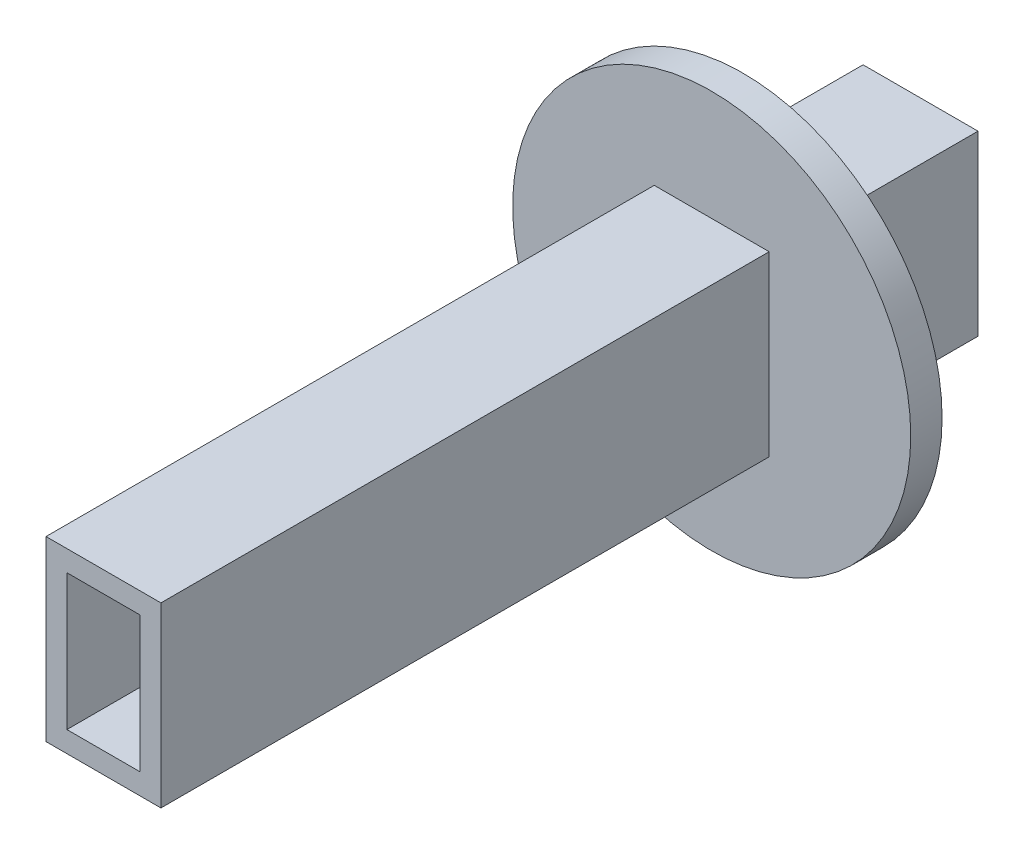
ISO-10303-21;
HEADER;
FILE_DESCRIPTION(('STEP AP214'),'2;1');
FILE_NAME('part.step','',(''),(''),'','','');
FILE_SCHEMA(('AUTOMOTIVE_DESIGN { 1 0 10303 214 1 1 1 1 }'));
ENDSEC;
DATA;
#1=APPLICATION_CONTEXT('core data for automotive mechanical design processes');
#2=APPLICATION_PROTOCOL_DEFINITION('international standard','automotive_design',2000,#1);
#3=PRODUCT_CONTEXT('',#1,'mechanical');
#4=PRODUCT('Part','Part','',(#3));
#5=PRODUCT_RELATED_PRODUCT_CATEGORY('part','',(#4));
#6=PRODUCT_DEFINITION_FORMATION('','',#4);
#7=PRODUCT_DEFINITION_CONTEXT('part definition',#1,'design');
#8=PRODUCT_DEFINITION('design','',#6,#7);
#9=PRODUCT_DEFINITION_SHAPE('','',#8);
#10=(LENGTH_UNIT() NAMED_UNIT(*) SI_UNIT(.MILLI.,.METRE.));
#11=(NAMED_UNIT(*) PLANE_ANGLE_UNIT() SI_UNIT($,.RADIAN.));
#12=(NAMED_UNIT(*) SI_UNIT($,.STERADIAN.) SOLID_ANGLE_UNIT());
#13=UNCERTAINTY_MEASURE_WITH_UNIT(LENGTH_MEASURE(1.E-05),#10,'distance_accuracy_value','');
#14=(GEOMETRIC_REPRESENTATION_CONTEXT(3) GLOBAL_UNCERTAINTY_ASSIGNED_CONTEXT((#13)) GLOBAL_UNIT_ASSIGNED_CONTEXT((#10,
#11,#12)) REPRESENTATION_CONTEXT('',''));
#15=CARTESIAN_POINT('',(0.,0.,0.));
#16=DIRECTION('',(0.,0.,1.));
#17=DIRECTION('',(1.,0.,0.));
#18=AXIS2_PLACEMENT_3D('',#15,#16,#17);
#19=CARTESIAN_POINT('',(3.5,6.5,14.986));
#20=DIRECTION('',(0.,0.,1.));
#21=DIRECTION('',(1.,0.,0.));
#22=AXIS2_PLACEMENT_3D('',#19,#20,#21);
#23=PLANE('',#22);
#24=CARTESIAN_POINT('',(3.5,6.5,14.986));
#25=DIRECTION('',(0.,0.,1.));
#26=DIRECTION('',(1.,0.,0.));
#27=AXIS2_PLACEMENT_3D('',#24,#25,#26);
#28=CIRCLE('',#27,19.05);
#29=CARTESIAN_POINT('',(22.55,6.5,14.986));
#30=VERTEX_POINT('',#29);
#31=EDGE_CURVE('E251',#30,#30,#28,.T.);
#32=ORIENTED_EDGE('',*,*,#31,.F.);
#33=EDGE_LOOP('',(#32));
#34=FACE_BOUND('',#33,.T.);
#35=CARTESIAN_POINT('',(3.5,6.5,14.986));
#36=DIRECTION('',(0.,0.,1.));
#37=DIRECTION('',(1.,0.,0.));
#38=AXIS2_PLACEMENT_3D('',#35,#36,#37);
#39=CIRCLE('',#38,12.7);
#40=CARTESIAN_POINT('',(16.2,6.5,14.986));
#41=VERTEX_POINT('',#40);
#42=EDGE_CURVE('E11',#41,#41,#39,.F.);
#43=ORIENTED_EDGE('',*,*,#42,.F.);
#44=EDGE_LOOP('',(#43));
#45=FACE_BOUND('',#44,.T.);
#46=ADVANCED_FACE('F36',(#34,#45),#23,.F.);
#47=CARTESIAN_POINT('',(-2.,-2.,76.2));
#48=DIRECTION('',(1.,0.,0.));
#49=DIRECTION('',(0.,0.,-1.));
#50=AXIS2_PLACEMENT_3D('',#47,#48,#49);
#51=PLANE('',#50);
#52=DIRECTION('',(0.,0.,-1.));
#53=VECTOR('',#52,1.);
#54=CARTESIAN_POINT('',(-2.,-2.,76.2));
#55=LINE('',#54,#53);
#56=CARTESIAN_POINT('',(-2.,-2.,12.446));
#57=VERTEX_POINT('',#56);
#58=CARTESIAN_POINT('',(-2.,-2.,-2.));
#59=VERTEX_POINT('',#58);
#60=EDGE_CURVE('E159',#57,#59,#55,.T.);
#61=ORIENTED_EDGE('',*,*,#60,.F.);
#62=DIRECTION('',(0.,1.,0.));
#63=VECTOR('',#62,1.);
#64=CARTESIAN_POINT('',(-2.,15.,12.446));
#65=LINE('',#64,#63);
#66=CARTESIAN_POINT('',(-2.,15.,12.446));
#67=VERTEX_POINT('',#66);
#68=EDGE_CURVE('E138',#57,#67,#65,.T.);
#69=ORIENTED_EDGE('',*,*,#68,.T.);
#70=DIRECTION('',(0.,0.,-1.));
#71=VECTOR('',#70,1.);
#72=CARTESIAN_POINT('',(-2.,15.,76.2));
#73=LINE('',#72,#71);
#74=CARTESIAN_POINT('',(-2.,15.,-2.));
#75=VERTEX_POINT('',#74);
#76=EDGE_CURVE('E179',#67,#75,#73,.T.);
#77=ORIENTED_EDGE('',*,*,#76,.T.);
#78=DIRECTION('',(0.,1.,0.));
#79=VECTOR('',#78,1.);
#80=CARTESIAN_POINT('',(-2.,-2.,-2.));
#81=LINE('',#80,#79);
#82=EDGE_CURVE('E173',#59,#75,#81,.T.);
#83=ORIENTED_EDGE('',*,*,#82,.F.);
#84=EDGE_LOOP('',(#61,#69,#77,#83));
#85=FACE_BOUND('',#84,.T.);
#86=ADVANCED_FACE('F177',(#85),#51,.F.);
#87=CARTESIAN_POINT('',(-2.,-2.,76.2));
#88=DIRECTION('',(0.,1.,0.));
#89=DIRECTION('',(0.,0.,1.));
#90=AXIS2_PLACEMENT_3D('',#87,#88,#89);
#91=PLANE('',#90);
#92=DIRECTION('',(0.,0.,-1.));
#93=VECTOR('',#92,1.);
#94=CARTESIAN_POINT('',(0.,-2.,0.));
#95=LINE('',#94,#93);
#96=CARTESIAN_POINT('',(0.,-2.,11.));
#97=VERTEX_POINT('',#96);
#98=CARTESIAN_POINT('',(0.,-2.,0.));
#99=VERTEX_POINT('',#98);
#100=EDGE_CURVE('E246',#97,#99,#95,.T.);
#101=ORIENTED_EDGE('',*,*,#100,.F.);
#102=DIRECTION('',(-1.,0.,0.));
#103=VECTOR('',#102,1.);
#104=CARTESIAN_POINT('',(7.,-2.,11.));
#105=LINE('',#104,#103);
#106=CARTESIAN_POINT('',(7.,-2.,11.));
#107=VERTEX_POINT('',#106);
#108=EDGE_CURVE('E242',#107,#97,#105,.T.);
#109=ORIENTED_EDGE('',*,*,#108,.F.);
#110=DIRECTION('',(0.,0.,1.));
#111=VECTOR('',#110,1.);
#112=CARTESIAN_POINT('',(7.,-2.,0.));
#113=LINE('',#112,#111);
#114=CARTESIAN_POINT('',(7.,-2.,0.));
#115=VERTEX_POINT('',#114);
#116=EDGE_CURVE('E239',#115,#107,#113,.T.);
#117=ORIENTED_EDGE('',*,*,#116,.F.);
#118=DIRECTION('',(1.,0.,0.));
#119=VECTOR('',#118,1.);
#120=CARTESIAN_POINT('',(7.,-2.,0.));
#121=LINE('',#120,#119);
#122=EDGE_CURVE('E238',#99,#115,#121,.T.);
#123=ORIENTED_EDGE('',*,*,#122,.F.);
#124=EDGE_LOOP('',(#101,#109,#117,#123));
#125=FACE_BOUND('',#124,.T.);
#126=DIRECTION('',(0.,0.,-1.));
#127=VECTOR('',#126,1.);
#128=CARTESIAN_POINT('',(9.,-2.,76.2));
#129=LINE('',#128,#127);
#130=CARTESIAN_POINT('',(9.,-2.,12.446));
#131=VERTEX_POINT('',#130);
#132=CARTESIAN_POINT('',(9.,-2.,-2.));
#133=VERTEX_POINT('',#132);
#134=EDGE_CURVE('E147',#131,#133,#129,.T.);
#135=ORIENTED_EDGE('',*,*,#134,.F.);
#136=DIRECTION('',(-1.,0.,0.));
#137=VECTOR('',#136,1.);
#138=CARTESIAN_POINT('',(9.,-2.,12.446));
#139=LINE('',#138,#137);
#140=EDGE_CURVE('E135',#131,#57,#139,.T.);
#141=ORIENTED_EDGE('',*,*,#140,.T.);
#142=ORIENTED_EDGE('',*,*,#60,.T.);
#143=DIRECTION('',(-1.,0.,0.));
#144=VECTOR('',#143,1.);
#145=CARTESIAN_POINT('',(9.,-2.,-2.));
#146=LINE('',#145,#144);
#147=EDGE_CURVE('E153',#133,#59,#146,.T.);
#148=ORIENTED_EDGE('',*,*,#147,.F.);
#149=EDGE_LOOP('',(#135,#141,#142,#148));
#150=FACE_BOUND('',#149,.T.);
#151=ADVANCED_FACE('F151',(#125,#150),#91,.F.);
#152=CARTESIAN_POINT('',(9.,-2.,76.2));
#153=DIRECTION('',(-1.,0.,0.));
#154=DIRECTION('',(0.,0.,1.));
#155=AXIS2_PLACEMENT_3D('',#152,#153,#154);
#156=PLANE('',#155);
#157=DIRECTION('',(0.,0.,-1.));
#158=VECTOR('',#157,1.);
#159=CARTESIAN_POINT('',(9.,15.,76.2));
#160=LINE('',#159,#158);
#161=CARTESIAN_POINT('',(9.,15.,12.446));
#162=VERTEX_POINT('',#161);
#163=CARTESIAN_POINT('',(9.,15.,-2.));
#164=VERTEX_POINT('',#163);
#165=EDGE_CURVE('E149',#162,#164,#160,.T.);
#166=ORIENTED_EDGE('',*,*,#165,.F.);
#167=DIRECTION('',(0.,-1.,0.));
#168=VECTOR('',#167,1.);
#169=CARTESIAN_POINT('',(9.,15.,12.446));
#170=LINE('',#169,#168);
#171=EDGE_CURVE('E51',#162,#131,#170,.T.);
#172=ORIENTED_EDGE('',*,*,#171,.T.);
#173=ORIENTED_EDGE('',*,*,#134,.T.);
#174=DIRECTION('',(0.,-1.,0.));
#175=VECTOR('',#174,1.);
#176=CARTESIAN_POINT('',(9.,-2.,-2.));
#177=LINE('',#176,#175);
#178=EDGE_CURVE('E175',#164,#133,#177,.T.);
#179=ORIENTED_EDGE('',*,*,#178,.F.);
#180=EDGE_LOOP('',(#166,#172,#173,#179));
#181=FACE_BOUND('',#180,.T.);
#182=ADVANCED_FACE('F145',(#181),#156,.F.);
#183=CARTESIAN_POINT('',(-2.,15.,76.2));
#184=DIRECTION('',(0.,-1.,0.));
#185=DIRECTION('',(0.,0.,-1.));
#186=AXIS2_PLACEMENT_3D('',#183,#184,#185);
#187=PLANE('',#186);
#188=ORIENTED_EDGE('',*,*,#76,.F.);
#189=DIRECTION('',(1.,0.,0.));
#190=VECTOR('',#189,1.);
#191=CARTESIAN_POINT('',(9.,15.,12.446));
#192=LINE('',#191,#190);
#193=EDGE_CURVE('E229',#67,#162,#192,.T.);
#194=ORIENTED_EDGE('',*,*,#193,.T.);
#195=ORIENTED_EDGE('',*,*,#165,.T.);
#196=DIRECTION('',(1.,0.,0.));
#197=VECTOR('',#196,1.);
#198=CARTESIAN_POINT('',(9.,15.,-2.));
#199=LINE('',#198,#197);
#200=EDGE_CURVE('E180',#75,#164,#199,.T.);
#201=ORIENTED_EDGE('',*,*,#200,.F.);
#202=EDGE_LOOP('',(#188,#194,#195,#201));
#203=FACE_BOUND('',#202,.T.);
#204=ADVANCED_FACE('F228',(#203),#187,.F.);
#205=CARTESIAN_POINT('',(0.,0.,76.2));
#206=DIRECTION('',(0.,0.,-1.));
#207=DIRECTION('',(-1.,0.,0.));
#208=AXIS2_PLACEMENT_3D('',#205,#206,#207);
#209=PLANE('',#208);
#210=DIRECTION('',(0.,-1.,0.));
#211=VECTOR('',#210,1.);
#212=CARTESIAN_POINT('',(-2.,-2.,76.2));
#213=LINE('',#212,#211);
#214=CARTESIAN_POINT('',(-2.,15.,76.2));
#215=VERTEX_POINT('',#214);
#216=CARTESIAN_POINT('',(-2.,-2.,76.2));
#217=VERTEX_POINT('',#216);
#218=EDGE_CURVE('E214',#215,#217,#213,.T.);
#219=ORIENTED_EDGE('',*,*,#218,.T.);
#220=DIRECTION('',(1.,0.,0.));
#221=VECTOR('',#220,1.);
#222=CARTESIAN_POINT('',(-2.,-2.,76.2));
#223=LINE('',#222,#221);
#224=CARTESIAN_POINT('',(9.,-2.,76.2));
#225=VERTEX_POINT('',#224);
#226=EDGE_CURVE('E217',#217,#225,#223,.T.);
#227=ORIENTED_EDGE('',*,*,#226,.T.);
#228=DIRECTION('',(0.,1.,0.));
#229=VECTOR('',#228,1.);
#230=CARTESIAN_POINT('',(9.,-2.,76.2));
#231=LINE('',#230,#229);
#232=CARTESIAN_POINT('',(9.,15.,76.2));
#233=VERTEX_POINT('',#232);
#234=EDGE_CURVE('E219',#225,#233,#231,.T.);
#235=ORIENTED_EDGE('',*,*,#234,.T.);
#236=DIRECTION('',(-1.,0.,0.));
#237=VECTOR('',#236,1.);
#238=CARTESIAN_POINT('',(-2.,15.,76.2));
#239=LINE('',#238,#237);
#240=EDGE_CURVE('E221',#233,#215,#239,.T.);
#241=ORIENTED_EDGE('',*,*,#240,.T.);
#242=EDGE_LOOP('',(#219,#227,#235,#241));
#243=FACE_BOUND('',#242,.T.);
#244=DIRECTION('',(0.,-1.,0.));
#245=VECTOR('',#244,1.);
#246=CARTESIAN_POINT('',(0.,0.,76.2));
#247=LINE('',#246,#245);
#248=CARTESIAN_POINT('',(0.,13.,76.2));
#249=VERTEX_POINT('',#248);
#250=CARTESIAN_POINT('',(0.,0.,76.2));
#251=VERTEX_POINT('',#250);
#252=EDGE_CURVE('E186',#249,#251,#247,.T.);
#253=ORIENTED_EDGE('',*,*,#252,.F.);
#254=DIRECTION('',(-1.,0.,0.));
#255=VECTOR('',#254,1.);
#256=CARTESIAN_POINT('',(0.,13.,76.2));
#257=LINE('',#256,#255);
#258=CARTESIAN_POINT('',(7.,13.,76.2));
#259=VERTEX_POINT('',#258);
#260=EDGE_CURVE('E194',#259,#249,#257,.T.);
#261=ORIENTED_EDGE('',*,*,#260,.F.);
#262=DIRECTION('',(0.,1.,0.));
#263=VECTOR('',#262,1.);
#264=CARTESIAN_POINT('',(7.,0.,76.2));
#265=LINE('',#264,#263);
#266=CARTESIAN_POINT('',(7.,0.,76.2));
#267=VERTEX_POINT('',#266);
#268=EDGE_CURVE('E191',#267,#259,#265,.T.);
#269=ORIENTED_EDGE('',*,*,#268,.F.);
#270=DIRECTION('',(1.,0.,0.));
#271=VECTOR('',#270,1.);
#272=CARTESIAN_POINT('',(0.,0.,76.2));
#273=LINE('',#272,#271);
#274=EDGE_CURVE('E188',#251,#267,#273,.T.);
#275=ORIENTED_EDGE('',*,*,#274,.F.);
#276=EDGE_LOOP('',(#253,#261,#269,#275));
#277=FACE_BOUND('',#276,.T.);
#278=ADVANCED_FACE('F318',(#243,#277),#209,.F.);
#279=CARTESIAN_POINT('',(-2.,15.,17.986));
#280=VERTEX_POINT('',#279);
#281=EDGE_CURVE('E222',#215,#280,#73,.T.);
#282=ORIENTED_EDGE('',*,*,#281,.T.);
#283=DIRECTION('',(0.,-1.,0.));
#284=VECTOR('',#283,1.);
#285=CARTESIAN_POINT('',(-2.,15.,17.986));
#286=LINE('',#285,#284);
#287=CARTESIAN_POINT('',(-2.,-2.,17.986));
#288=VERTEX_POINT('',#287);
#289=EDGE_CURVE('E59',#280,#288,#286,.T.);
#290=ORIENTED_EDGE('',*,*,#289,.T.);
#291=EDGE_CURVE('E44',#217,#288,#55,.T.);
#292=ORIENTED_EDGE('',*,*,#291,.F.);
#293=ORIENTED_EDGE('',*,*,#218,.F.);
#294=EDGE_LOOP('',(#282,#290,#292,#293));
#295=FACE_BOUND('',#294,.T.);
#296=ADVANCED_FACE('F38',(#295),#51,.F.);
#297=ORIENTED_EDGE('',*,*,#291,.T.);
#298=DIRECTION('',(1.,0.,0.));
#299=VECTOR('',#298,1.);
#300=CARTESIAN_POINT('',(-2.,-2.,17.986));
#301=LINE('',#300,#299);
#302=CARTESIAN_POINT('',(9.,-2.,17.986));
#303=VERTEX_POINT('',#302);
#304=EDGE_CURVE('E261',#288,#303,#301,.T.);
#305=ORIENTED_EDGE('',*,*,#304,.T.);
#306=EDGE_CURVE('E155',#225,#303,#129,.T.);
#307=ORIENTED_EDGE('',*,*,#306,.F.);
#308=ORIENTED_EDGE('',*,*,#226,.F.);
#309=EDGE_LOOP('',(#297,#305,#307,#308));
#310=FACE_BOUND('',#309,.T.);
#311=ADVANCED_FACE('F327',(#310),#91,.F.);
#312=ORIENTED_EDGE('',*,*,#306,.T.);
#313=DIRECTION('',(0.,1.,0.));
#314=VECTOR('',#313,1.);
#315=CARTESIAN_POINT('',(9.,15.,17.986));
#316=LINE('',#315,#314);
#317=CARTESIAN_POINT('',(9.,15.,17.986));
#318=VERTEX_POINT('',#317);
#319=EDGE_CURVE('E258',#303,#318,#316,.T.);
#320=ORIENTED_EDGE('',*,*,#319,.T.);
#321=EDGE_CURVE('E156',#233,#318,#160,.T.);
#322=ORIENTED_EDGE('',*,*,#321,.F.);
#323=ORIENTED_EDGE('',*,*,#234,.F.);
#324=EDGE_LOOP('',(#312,#320,#322,#323));
#325=FACE_BOUND('',#324,.T.);
#326=ADVANCED_FACE('F324',(#325),#156,.F.);
#327=ORIENTED_EDGE('',*,*,#321,.T.);
#328=DIRECTION('',(-1.,0.,0.));
#329=VECTOR('',#328,1.);
#330=CARTESIAN_POINT('',(-2.,15.,17.986));
#331=LINE('',#330,#329);
#332=EDGE_CURVE('E254',#318,#280,#331,.T.);
#333=ORIENTED_EDGE('',*,*,#332,.T.);
#334=ORIENTED_EDGE('',*,*,#281,.F.);
#335=ORIENTED_EDGE('',*,*,#240,.F.);
#336=EDGE_LOOP('',(#327,#333,#334,#335));
#337=FACE_BOUND('',#336,.T.);
#338=ADVANCED_FACE('F316',(#337),#187,.F.);
#339=CARTESIAN_POINT('',(0.,0.,76.2));
#340=DIRECTION('',(1.,0.,0.));
#341=DIRECTION('',(0.,1.,0.));
#342=AXIS2_PLACEMENT_3D('',#339,#340,#341);
#343=PLANE('',#342);
#344=DIRECTION('',(0.,-1.,0.));
#345=VECTOR('',#344,1.);
#346=CARTESIAN_POINT('',(0.,0.,0.));
#347=LINE('',#346,#345);
#348=CARTESIAN_POINT('',(0.,13.,0.));
#349=VERTEX_POINT('',#348);
#350=EDGE_CURVE('E182',#349,#99,#347,.T.);
#351=ORIENTED_EDGE('',*,*,#350,.F.);
#352=DIRECTION('',(0.,0.,-1.));
#353=VECTOR('',#352,1.);
#354=CARTESIAN_POINT('',(0.,13.,76.2));
#355=LINE('',#354,#353);
#356=EDGE_CURVE('E196',#249,#349,#355,.T.);
#357=ORIENTED_EDGE('',*,*,#356,.F.);
#358=ORIENTED_EDGE('',*,*,#252,.T.);
#359=DIRECTION('',(0.,0.,-1.));
#360=VECTOR('',#359,1.);
#361=CARTESIAN_POINT('',(0.,0.,76.2));
#362=LINE('',#361,#360);
#363=CARTESIAN_POINT('',(0.,0.,11.));
#364=VERTEX_POINT('',#363);
#365=EDGE_CURVE('E211',#251,#364,#362,.T.);
#366=ORIENTED_EDGE('',*,*,#365,.T.);
#367=DIRECTION('',(0.,-1.,0.));
#368=VECTOR('',#367,1.);
#369=CARTESIAN_POINT('',(0.,13.0384048104053,11.));
#370=LINE('',#369,#368);
#371=EDGE_CURVE('E231',#364,#97,#370,.T.);
#372=ORIENTED_EDGE('',*,*,#371,.T.);
#373=ORIENTED_EDGE('',*,*,#100,.T.);
#374=EDGE_LOOP('',(#351,#357,#358,#366,#372,#373));
#375=FACE_BOUND('',#374,.T.);
#376=ADVANCED_FACE('F312',(#375),#343,.T.);
#377=CARTESIAN_POINT('',(0.,0.,76.2));
#378=DIRECTION('',(0.,1.,0.));
#379=DIRECTION('',(0.,0.,1.));
#380=AXIS2_PLACEMENT_3D('',#377,#378,#379);
#381=PLANE('',#380);
#382=DIRECTION('',(-1.,0.,0.));
#383=VECTOR('',#382,1.);
#384=CARTESIAN_POINT('',(7.,0.,11.));
#385=LINE('',#384,#383);
#386=CARTESIAN_POINT('',(7.,0.,11.));
#387=VERTEX_POINT('',#386);
#388=EDGE_CURVE('E235',#387,#364,#385,.T.);
#389=ORIENTED_EDGE('',*,*,#388,.T.);
#390=ORIENTED_EDGE('',*,*,#365,.F.);
#391=ORIENTED_EDGE('',*,*,#274,.T.);
#392=DIRECTION('',(0.,0.,-1.));
#393=VECTOR('',#392,1.);
#394=CARTESIAN_POINT('',(7.,0.,76.2));
#395=LINE('',#394,#393);
#396=EDGE_CURVE('E208',#267,#387,#395,.T.);
#397=ORIENTED_EDGE('',*,*,#396,.T.);
#398=EDGE_LOOP('',(#389,#390,#391,#397));
#399=FACE_BOUND('',#398,.T.);
#400=ADVANCED_FACE('F308',(#399),#381,.T.);
#401=CARTESIAN_POINT('',(7.,0.,76.2));
#402=DIRECTION('',(-1.,0.,0.));
#403=DIRECTION('',(0.,-1.,0.));
#404=AXIS2_PLACEMENT_3D('',#401,#402,#403);
#405=PLANE('',#404);
#406=DIRECTION('',(0.,1.,0.));
#407=VECTOR('',#406,1.);
#408=CARTESIAN_POINT('',(7.,0.,0.));
#409=LINE('',#408,#407);
#410=CARTESIAN_POINT('',(7.,13.,0.));
#411=VERTEX_POINT('',#410);
#412=EDGE_CURVE('E198',#115,#411,#409,.T.);
#413=ORIENTED_EDGE('',*,*,#412,.F.);
#414=ORIENTED_EDGE('',*,*,#116,.T.);
#415=DIRECTION('',(0.,-1.,0.));
#416=VECTOR('',#415,1.);
#417=CARTESIAN_POINT('',(7.,13.0384048104053,11.));
#418=LINE('',#417,#416);
#419=EDGE_CURVE('E230',#387,#107,#418,.T.);
#420=ORIENTED_EDGE('',*,*,#419,.F.);
#421=ORIENTED_EDGE('',*,*,#396,.F.);
#422=ORIENTED_EDGE('',*,*,#268,.T.);
#423=DIRECTION('',(0.,0.,-1.));
#424=VECTOR('',#423,1.);
#425=CARTESIAN_POINT('',(7.,13.,76.2));
#426=LINE('',#425,#424);
#427=EDGE_CURVE('E205',#259,#411,#426,.T.);
#428=ORIENTED_EDGE('',*,*,#427,.T.);
#429=EDGE_LOOP('',(#413,#414,#420,#421,#422,#428));
#430=FACE_BOUND('',#429,.T.);
#431=ADVANCED_FACE('F304',(#430),#405,.T.);
#432=CARTESIAN_POINT('',(0.,13.,76.2));
#433=DIRECTION('',(0.,-1.,0.));
#434=DIRECTION('',(0.,0.,-1.));
#435=AXIS2_PLACEMENT_3D('',#432,#433,#434);
#436=PLANE('',#435);
#437=DIRECTION('',(-1.,0.,0.));
#438=VECTOR('',#437,1.);
#439=CARTESIAN_POINT('',(0.,13.,0.));
#440=LINE('',#439,#438);
#441=EDGE_CURVE('E189',#411,#349,#440,.T.);
#442=ORIENTED_EDGE('',*,*,#441,.F.);
#443=ORIENTED_EDGE('',*,*,#427,.F.);
#444=ORIENTED_EDGE('',*,*,#260,.T.);
#445=ORIENTED_EDGE('',*,*,#356,.T.);
#446=EDGE_LOOP('',(#442,#443,#444,#445));
#447=FACE_BOUND('',#446,.T.);
#448=ADVANCED_FACE('F300',(#447),#436,.T.);
#449=CARTESIAN_POINT('',(0.,0.,0.));
#450=DIRECTION('',(0.,0.,1.));
#451=DIRECTION('',(1.,0.,0.));
#452=AXIS2_PLACEMENT_3D('',#449,#450,#451);
#453=PLANE('',#452);
#454=ORIENTED_EDGE('',*,*,#412,.T.);
#455=ORIENTED_EDGE('',*,*,#441,.T.);
#456=ORIENTED_EDGE('',*,*,#350,.T.);
#457=ORIENTED_EDGE('',*,*,#122,.T.);
#458=EDGE_LOOP('',(#454,#455,#456,#457));
#459=FACE_BOUND('',#458,.T.);
#460=ADVANCED_FACE('F297',(#459),#453,.T.);
#461=CARTESIAN_POINT('',(0.,0.,-2.));
#462=DIRECTION('',(0.,0.,1.));
#463=DIRECTION('',(1.,0.,0.));
#464=AXIS2_PLACEMENT_3D('',#461,#462,#463);
#465=PLANE('',#464);
#466=ORIENTED_EDGE('',*,*,#178,.T.);
#467=ORIENTED_EDGE('',*,*,#147,.T.);
#468=ORIENTED_EDGE('',*,*,#82,.T.);
#469=ORIENTED_EDGE('',*,*,#200,.T.);
#470=EDGE_LOOP('',(#466,#467,#468,#469));
#471=FACE_BOUND('',#470,.T.);
#472=ADVANCED_FACE('F171',(#471),#465,.F.);
#473=CARTESIAN_POINT('',(7.,13.0384048104053,11.));
#474=DIRECTION('',(0.,0.,1.));
#475=DIRECTION('',(1.,0.,0.));
#476=AXIS2_PLACEMENT_3D('',#473,#474,#475);
#477=PLANE('',#476);
#478=ORIENTED_EDGE('',*,*,#419,.T.);
#479=ORIENTED_EDGE('',*,*,#108,.T.);
#480=ORIENTED_EDGE('',*,*,#371,.F.);
#481=ORIENTED_EDGE('',*,*,#388,.F.);
#482=EDGE_LOOP('',(#478,#479,#480,#481));
#483=FACE_BOUND('',#482,.T.);
#484=ADVANCED_FACE('F291',(#483),#477,.F.);
#485=CARTESIAN_POINT('',(3.5,6.5,17.986));
#486=DIRECTION('',(0.,0.,1.));
#487=DIRECTION('',(1.,0.,0.));
#488=AXIS2_PLACEMENT_3D('',#485,#486,#487);
#489=PLANE('',#488);
#490=CARTESIAN_POINT('',(3.5,6.5,17.986));
#491=DIRECTION('',(0.,0.,1.));
#492=DIRECTION('',(1.,0.,0.));
#493=AXIS2_PLACEMENT_3D('',#490,#491,#492);
#494=CIRCLE('',#493,19.05);
#495=CARTESIAN_POINT('',(22.55,6.5,17.986));
#496=VERTEX_POINT('',#495);
#497=EDGE_CURVE('E243',#496,#496,#494,.T.);
#498=ORIENTED_EDGE('',*,*,#497,.T.);
#499=EDGE_LOOP('',(#498));
#500=FACE_BOUND('',#499,.T.);
#501=ORIENTED_EDGE('',*,*,#304,.F.);
#502=ORIENTED_EDGE('',*,*,#289,.F.);
#503=ORIENTED_EDGE('',*,*,#332,.F.);
#504=ORIENTED_EDGE('',*,*,#319,.F.);
#505=EDGE_LOOP('',(#501,#502,#503,#504));
#506=FACE_BOUND('',#505,.T.);
#507=ADVANCED_FACE('F286',(#500,#506),#489,.T.);
#508=CARTESIAN_POINT('',(3.5,6.5,17.986));
#509=DIRECTION('',(0.,0.,-1.));
#510=DIRECTION('',(-1.,0.,0.));
#511=AXIS2_PLACEMENT_3D('',#508,#509,#510);
#512=CYLINDRICAL_SURFACE('',#511,19.05);
#513=ORIENTED_EDGE('',*,*,#497,.F.);
#514=EDGE_LOOP('',(#513));
#515=FACE_BOUND('',#514,.T.);
#516=ORIENTED_EDGE('',*,*,#31,.T.);
#517=EDGE_LOOP('',(#516));
#518=FACE_BOUND('',#517,.T.);
#519=ADVANCED_FACE('F287',(#515,#518),#512,.T.);
#520=CARTESIAN_POINT('',(3.5,6.5,12.446));
#521=DIRECTION('',(0.,0.,-1.));
#522=DIRECTION('',(-1.,0.,0.));
#523=AXIS2_PLACEMENT_3D('',#520,#521,#522);
#524=PLANE('',#523);
#525=CARTESIAN_POINT('',(3.5,6.5,12.446));
#526=DIRECTION('',(0.,0.,-1.));
#527=DIRECTION('',(-1.,0.,0.));
#528=AXIS2_PLACEMENT_3D('',#525,#526,#527);
#529=CIRCLE('',#528,12.7);
#530=CARTESIAN_POINT('',(-9.2,6.5,12.446));
#531=VERTEX_POINT('',#530);
#532=EDGE_CURVE('E264',#531,#531,#529,.T.);
#533=ORIENTED_EDGE('',*,*,#532,.T.);
#534=EDGE_LOOP('',(#533));
#535=FACE_BOUND('',#534,.T.);
#536=ORIENTED_EDGE('',*,*,#140,.F.);
#537=ORIENTED_EDGE('',*,*,#171,.F.);
#538=ORIENTED_EDGE('',*,*,#193,.F.);
#539=ORIENTED_EDGE('',*,*,#68,.F.);
#540=EDGE_LOOP('',(#536,#537,#538,#539));
#541=FACE_BOUND('',#540,.T.);
#542=ADVANCED_FACE('F136',(#535,#541),#524,.T.);
#543=CARTESIAN_POINT('',(3.5,6.5,12.446));
#544=DIRECTION('',(0.,0.,1.));
#545=DIRECTION('',(1.,0.,0.));
#546=AXIS2_PLACEMENT_3D('',#543,#544,#545);
#547=CYLINDRICAL_SURFACE('',#546,12.7);
#548=ORIENTED_EDGE('',*,*,#532,.F.);
#549=EDGE_LOOP('',(#548));
#550=FACE_BOUND('',#549,.T.);
#551=ORIENTED_EDGE('',*,*,#42,.T.);
#552=EDGE_LOOP('',(#551));
#553=FACE_BOUND('',#552,.T.);
#554=ADVANCED_FACE('F271',(#550,#553),#547,.T.);
#555=CLOSED_SHELL('',(#46,#86,#151,#182,#204,#278,#296,#311,#326,#338,#376,#400,#431,#448,#460,
#472,#484,#507,#519,#542,#554));
#556=MANIFOLD_SOLID_BREP('B2',#555);
#557=ADVANCED_BREP_SHAPE_REPRESENTATION('',(#18,#556),#14);
#558=SHAPE_DEFINITION_REPRESENTATION(#9,#557);
ENDSEC;
END-ISO-10303-21;
